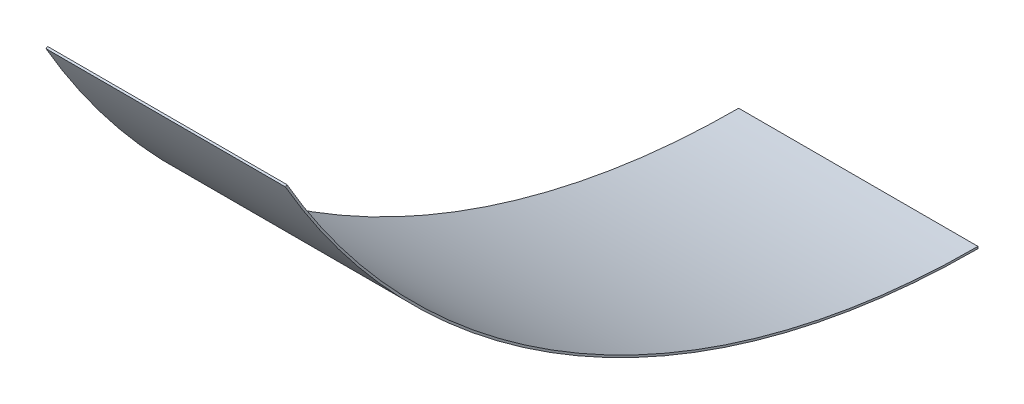
ISO-10303-21;
HEADER;
FILE_DESCRIPTION(('STEP AP214'),'2;1');
FILE_NAME('part.step','',(''),(''),'','','');
FILE_SCHEMA(('AUTOMOTIVE_DESIGN { 1 0 10303 214 1 1 1 1 }'));
ENDSEC;
DATA;
#1=APPLICATION_CONTEXT('core data for automotive mechanical design processes');
#2=APPLICATION_PROTOCOL_DEFINITION('international standard','automotive_design',2000,#1);
#3=PRODUCT_CONTEXT('',#1,'mechanical');
#4=PRODUCT('Part','Part','',(#3));
#5=PRODUCT_RELATED_PRODUCT_CATEGORY('part','',(#4));
#6=PRODUCT_DEFINITION_FORMATION('','',#4);
#7=PRODUCT_DEFINITION_CONTEXT('part definition',#1,'design');
#8=PRODUCT_DEFINITION('design','',#6,#7);
#9=PRODUCT_DEFINITION_SHAPE('','',#8);
#10=(LENGTH_UNIT() NAMED_UNIT(*) SI_UNIT(.MILLI.,.METRE.));
#11=(NAMED_UNIT(*) PLANE_ANGLE_UNIT() SI_UNIT($,.RADIAN.));
#12=(NAMED_UNIT(*) SI_UNIT($,.STERADIAN.) SOLID_ANGLE_UNIT());
#13=UNCERTAINTY_MEASURE_WITH_UNIT(LENGTH_MEASURE(1.E-05),#10,'distance_accuracy_value','');
#14=(GEOMETRIC_REPRESENTATION_CONTEXT(3) GLOBAL_UNCERTAINTY_ASSIGNED_CONTEXT((#13)) GLOBAL_UNIT_ASSIGNED_CONTEXT((#10,
#11,#12)) REPRESENTATION_CONTEXT('',''));
#15=CARTESIAN_POINT('',(0.,0.,0.));
#16=DIRECTION('',(0.,0.,1.));
#17=DIRECTION('',(1.,0.,0.));
#18=AXIS2_PLACEMENT_3D('',#15,#16,#17);
#19=CARTESIAN_POINT('',(0.,25.4679739941001,44.1118249236241));
#20=DIRECTION('',(-1.,0.,0.));
#21=DIRECTION('',(0.,0.,1.));
#22=AXIS2_PLACEMENT_3D('',#19,#20,#21);
#23=PLANE('',#22);
#24=CARTESIAN_POINT('',(0.,50.9359479882,0.));
#25=DIRECTION('',(1.,0.,0.));
#26=DIRECTION('',(0.,0.,-1.));
#27=AXIS2_PLACEMENT_3D('',#24,#25,#26);
#28=CIRCLE('',#27,50.8089479882);
#29=CARTESIAN_POINT('',(0.,25.5314739941001,44.0018396973435));
#30=VERTEX_POINT('',#29);
#31=CARTESIAN_POINT('',(0.,0.127,0.));
#32=VERTEX_POINT('',#31);
#33=EDGE_CURVE('E11',#30,#32,#28,.T.);
#34=ORIENTED_EDGE('',*,*,#33,.F.);
#35=DIRECTION('',(0.,0.499999999999998,-0.86602540378444));
#36=VECTOR('',#35,1.);
#37=CARTESIAN_POINT('',(0.,25.4679739941001,44.1118249236241));
#38=LINE('',#37,#36);
#39=CARTESIAN_POINT('',(0.,25.4679739941001,44.1118249236241));
#40=VERTEX_POINT('',#39);
#41=EDGE_CURVE('E106',#40,#30,#38,.T.);
#42=ORIENTED_EDGE('',*,*,#41,.F.);
#43=CARTESIAN_POINT('',(0.,50.9359479882,0.));
#44=DIRECTION('',(1.,0.,0.));
#45=DIRECTION('',(0.,0.,-1.));
#46=AXIS2_PLACEMENT_3D('',#43,#44,#45);
#47=CIRCLE('',#46,50.9359479882);
#48=CARTESIAN_POINT('',(0.,0.,0.));
#49=VERTEX_POINT('',#48);
#50=EDGE_CURVE('E55',#40,#49,#47,.T.);
#51=ORIENTED_EDGE('',*,*,#50,.T.);
#52=DIRECTION('',(0.,1.,0.));
#53=VECTOR('',#52,1.);
#54=CARTESIAN_POINT('',(0.,0.,0.));
#55=LINE('',#54,#53);
#56=EDGE_CURVE('E91',#49,#32,#55,.T.);
#57=ORIENTED_EDGE('',*,*,#56,.T.);
#58=EDGE_LOOP('',(#34,#42,#51,#57));
#59=FACE_BOUND('',#58,.T.);
#60=ADVANCED_FACE('F39',(#59),#23,.F.);
#61=CARTESIAN_POINT('',(-4.31408565657697E-13,50.9359479882,0.));
#62=DIRECTION('',(1.,0.,0.));
#63=DIRECTION('',(0.,0.,-1.));
#64=AXIS2_PLACEMENT_3D('',#61,#62,#63);
#65=CYLINDRICAL_SURFACE('',#64,50.8089479882);
#66=CARTESIAN_POINT('',(-15.24,50.9359479882,0.));
#67=DIRECTION('',(1.,0.,0.));
#68=DIRECTION('',(0.,0.,-1.));
#69=AXIS2_PLACEMENT_3D('',#66,#67,#68);
#70=CIRCLE('',#69,50.8089479882);
#71=CARTESIAN_POINT('',(-15.24,25.5314739941001,44.0018396973435));
#72=VERTEX_POINT('',#71);
#73=CARTESIAN_POINT('',(-15.24,0.126999999999998,0.));
#74=VERTEX_POINT('',#73);
#75=EDGE_CURVE('E48',#72,#74,#70,.T.);
#76=ORIENTED_EDGE('',*,*,#75,.F.);
#77=DIRECTION('',(-1.,0.,0.));
#78=VECTOR('',#77,1.);
#79=CARTESIAN_POINT('',(0.,25.5314739941001,44.0018396973435));
#80=LINE('',#79,#78);
#81=EDGE_CURVE('E87',#30,#72,#80,.T.);
#82=ORIENTED_EDGE('',*,*,#81,.F.);
#83=ORIENTED_EDGE('',*,*,#33,.T.);
#84=DIRECTION('',(-1.,0.,0.));
#85=VECTOR('',#84,1.);
#86=CARTESIAN_POINT('',(0.,0.127,0.));
#87=LINE('',#86,#85);
#88=EDGE_CURVE('E84',#32,#74,#87,.T.);
#89=ORIENTED_EDGE('',*,*,#88,.T.);
#90=EDGE_LOOP('',(#76,#82,#83,#89));
#91=FACE_BOUND('',#90,.T.);
#92=ADVANCED_FACE('F41',(#91),#65,.F.);
#93=CARTESIAN_POINT('',(-15.24,25.4679739941001,44.1118249236241));
#94=DIRECTION('',(1.,0.,0.));
#95=DIRECTION('',(0.,0.,-1.));
#96=AXIS2_PLACEMENT_3D('',#93,#94,#95);
#97=PLANE('',#96);
#98=CARTESIAN_POINT('',(-15.24,50.9359479882,0.));
#99=DIRECTION('',(1.,0.,0.));
#100=DIRECTION('',(0.,0.,-1.));
#101=AXIS2_PLACEMENT_3D('',#98,#99,#100);
#102=CIRCLE('',#101,50.9359479882);
#103=CARTESIAN_POINT('',(-15.24,25.4679739941001,44.1118249236241));
#104=VERTEX_POINT('',#103);
#105=CARTESIAN_POINT('',(-15.24,0.,0.));
#106=VERTEX_POINT('',#105);
#107=EDGE_CURVE('E63',#104,#106,#102,.T.);
#108=ORIENTED_EDGE('',*,*,#107,.F.);
#109=DIRECTION('',(0.,-0.499999999999998,0.86602540378444));
#110=VECTOR('',#109,1.);
#111=CARTESIAN_POINT('',(-15.24,25.4679739941001,44.1118249236241));
#112=LINE('',#111,#110);
#113=EDGE_CURVE('E111',#72,#104,#112,.T.);
#114=ORIENTED_EDGE('',*,*,#113,.F.);
#115=ORIENTED_EDGE('',*,*,#75,.T.);
#116=DIRECTION('',(0.,-1.,0.));
#117=VECTOR('',#116,1.);
#118=CARTESIAN_POINT('',(-15.24,0.,0.));
#119=LINE('',#118,#117);
#120=EDGE_CURVE('E97',#74,#106,#119,.T.);
#121=ORIENTED_EDGE('',*,*,#120,.T.);
#122=EDGE_LOOP('',(#108,#114,#115,#121));
#123=FACE_BOUND('',#122,.T.);
#124=ADVANCED_FACE('F122',(#123),#97,.F.);
#125=CARTESIAN_POINT('',(-4.31408565657697E-13,50.9359479882,0.));
#126=DIRECTION('',(1.,0.,0.));
#127=DIRECTION('',(0.,0.,-1.));
#128=AXIS2_PLACEMENT_3D('',#125,#126,#127);
#129=CYLINDRICAL_SURFACE('',#128,50.9359479882);
#130=DIRECTION('',(1.,0.,0.));
#131=VECTOR('',#130,1.);
#132=CARTESIAN_POINT('',(0.,25.4679739941001,44.1118249236241));
#133=LINE('',#132,#131);
#134=EDGE_CURVE('E114',#104,#40,#133,.T.);
#135=ORIENTED_EDGE('',*,*,#134,.F.);
#136=ORIENTED_EDGE('',*,*,#107,.T.);
#137=DIRECTION('',(1.,0.,0.));
#138=VECTOR('',#137,1.);
#139=CARTESIAN_POINT('',(0.,0.,0.));
#140=LINE('',#139,#138);
#141=EDGE_CURVE('E101',#106,#49,#140,.T.);
#142=ORIENTED_EDGE('',*,*,#141,.T.);
#143=ORIENTED_EDGE('',*,*,#50,.F.);
#144=EDGE_LOOP('',(#135,#136,#142,#143));
#145=FACE_BOUND('',#144,.T.);
#146=ADVANCED_FACE('F125',(#145),#129,.T.);
#147=CARTESIAN_POINT('',(0.,25.4679739941001,44.1118249236241));
#148=DIRECTION('',(0.,0.86602540378444,0.499999999999998));
#149=DIRECTION('',(1.,0.,0.));
#150=AXIS2_PLACEMENT_3D('',#147,#148,#149);
#151=PLANE('',#150);
#152=ORIENTED_EDGE('',*,*,#41,.T.);
#153=ORIENTED_EDGE('',*,*,#81,.T.);
#154=ORIENTED_EDGE('',*,*,#113,.T.);
#155=ORIENTED_EDGE('',*,*,#134,.T.);
#156=EDGE_LOOP('',(#152,#153,#154,#155));
#157=FACE_BOUND('',#156,.T.);
#158=ADVANCED_FACE('F124',(#157),#151,.T.);
#159=CARTESIAN_POINT('',(0.,0.,0.));
#160=DIRECTION('',(0.,0.,1.));
#161=DIRECTION('',(1.,0.,0.));
#162=AXIS2_PLACEMENT_3D('',#159,#160,#161);
#163=PLANE('',#162);
#164=ORIENTED_EDGE('',*,*,#56,.F.);
#165=ORIENTED_EDGE('',*,*,#141,.F.);
#166=ORIENTED_EDGE('',*,*,#120,.F.);
#167=ORIENTED_EDGE('',*,*,#88,.F.);
#168=EDGE_LOOP('',(#164,#165,#166,#167));
#169=FACE_BOUND('',#168,.T.);
#170=ADVANCED_FACE('F96',(#169),#163,.F.);
#171=CLOSED_SHELL('',(#60,#92,#124,#146,#158,#170));
#172=MANIFOLD_SOLID_BREP('B2',#171);
#173=ADVANCED_BREP_SHAPE_REPRESENTATION('',(#18,#172),#14);
#174=SHAPE_DEFINITION_REPRESENTATION(#9,#173);
ENDSEC;
END-ISO-10303-21;
